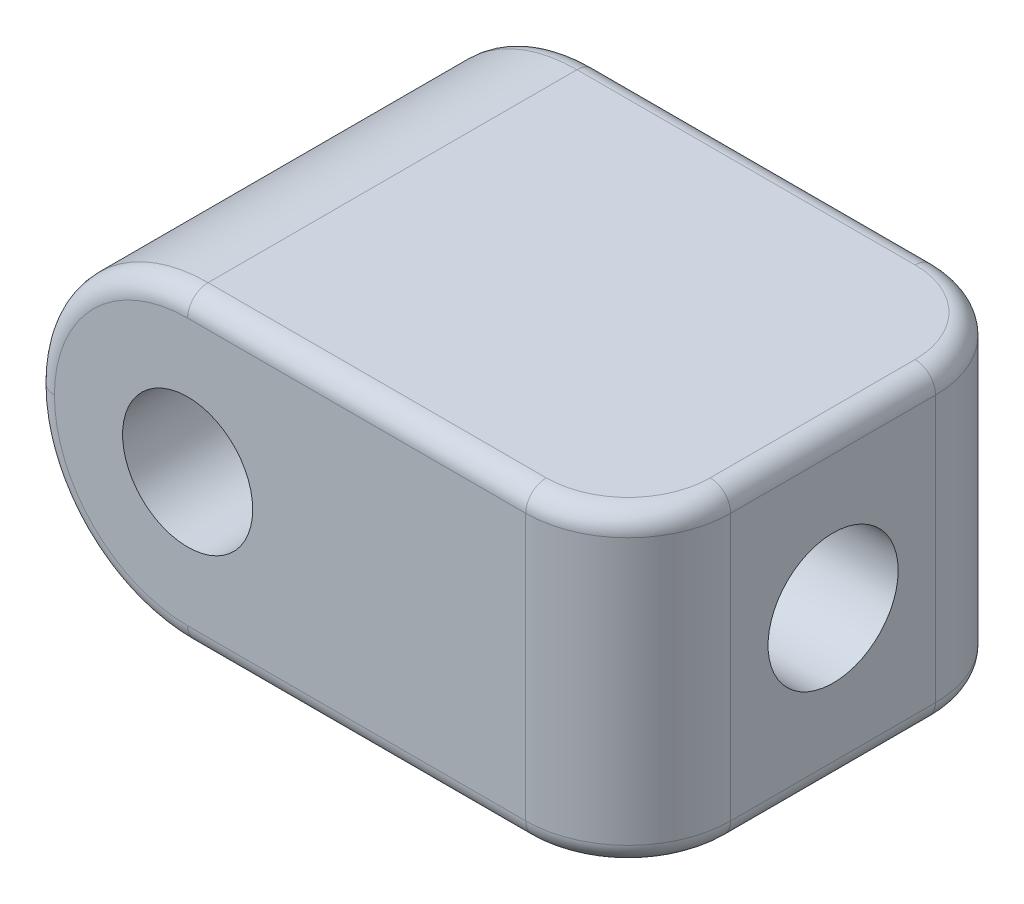
ISO-10303-21;
HEADER;
FILE_DESCRIPTION(('STEP AP214'),'2;1');
FILE_NAME('part.step','',(''),(''),'','','');
FILE_SCHEMA(('AUTOMOTIVE_DESIGN { 1 0 10303 214 1 1 1 1 }'));
ENDSEC;
DATA;
#1=APPLICATION_CONTEXT('core data for automotive mechanical design processes');
#2=APPLICATION_PROTOCOL_DEFINITION('international standard','automotive_design',2000,#1);
#3=PRODUCT_CONTEXT('',#1,'mechanical');
#4=PRODUCT('Part','Part','',(#3));
#5=PRODUCT_RELATED_PRODUCT_CATEGORY('part','',(#4));
#6=PRODUCT_DEFINITION_FORMATION('','',#4);
#7=PRODUCT_DEFINITION_CONTEXT('part definition',#1,'design');
#8=PRODUCT_DEFINITION('design','',#6,#7);
#9=PRODUCT_DEFINITION_SHAPE('','',#8);
#10=(LENGTH_UNIT() NAMED_UNIT(*) SI_UNIT(.MILLI.,.METRE.));
#11=(NAMED_UNIT(*) PLANE_ANGLE_UNIT() SI_UNIT($,.RADIAN.));
#12=(NAMED_UNIT(*) SI_UNIT($,.STERADIAN.) SOLID_ANGLE_UNIT());
#13=UNCERTAINTY_MEASURE_WITH_UNIT(LENGTH_MEASURE(1.E-05),#10,'distance_accuracy_value','');
#14=(GEOMETRIC_REPRESENTATION_CONTEXT(3) GLOBAL_UNCERTAINTY_ASSIGNED_CONTEXT((#13)) GLOBAL_UNIT_ASSIGNED_CONTEXT((#10,
#11,#12)) REPRESENTATION_CONTEXT('',''));
#15=CARTESIAN_POINT('',(0.,0.,0.));
#16=DIRECTION('',(0.,0.,1.));
#17=DIRECTION('',(1.,0.,0.));
#18=AXIS2_PLACEMENT_3D('',#15,#16,#17);
#19=CARTESIAN_POINT('',(-14.5,7.5,10.));
#20=DIRECTION('',(0.,0.,-1.));
#21=DIRECTION('',(-1.,0.,0.));
#22=AXIS2_PLACEMENT_3D('',#19,#20,#21);
#23=PLANE('',#22);
#24=CARTESIAN_POINT('',(-7.,0.,10.));
#25=DIRECTION('',(0.,0.,1.));
#26=DIRECTION('',(1.,0.,0.));
#27=AXIS2_PLACEMENT_3D('',#24,#25,#26);
#28=CIRCLE('',#27,3.175);
#29=CARTESIAN_POINT('',(-3.825,0.,10.));
#30=VERTEX_POINT('',#29);
#31=EDGE_CURVE('E147',#30,#30,#28,.T.);
#32=ORIENTED_EDGE('',*,*,#31,.F.);
#33=EDGE_LOOP('',(#32));
#34=FACE_BOUND('',#33,.T.);
#35=CARTESIAN_POINT('',(-7.,0.,10.));
#36=DIRECTION('',(0.,0.,-1.));
#37=DIRECTION('',(-1.,0.,0.));
#38=AXIS2_PLACEMENT_3D('',#35,#36,#37);
#39=CIRCLE('',#38,6.5);
#40=CARTESIAN_POINT('',(-13.5,0.,10.));
#41=VERTEX_POINT('',#40);
#42=CARTESIAN_POINT('',(-7.,-6.5,10.));
#43=VERTEX_POINT('',#42);
#44=EDGE_CURVE('E180',#41,#43,#39,.F.);
#45=ORIENTED_EDGE('',*,*,#44,.T.);
#46=DIRECTION('',(1.,0.,0.));
#47=VECTOR('',#46,1.);
#48=CARTESIAN_POINT('',(-14.5,-6.5,10.));
#49=LINE('',#48,#47);
#50=CARTESIAN_POINT('',(9.5,-6.5,10.));
#51=VERTEX_POINT('',#50);
#52=EDGE_CURVE('E182',#43,#51,#49,.T.);
#53=ORIENTED_EDGE('',*,*,#52,.T.);
#54=DIRECTION('',(0.,-1.,0.));
#55=VECTOR('',#54,1.);
#56=CARTESIAN_POINT('',(9.5,7.5,10.));
#57=LINE('',#56,#55);
#58=CARTESIAN_POINT('',(9.5,6.5,10.));
#59=VERTEX_POINT('',#58);
#60=EDGE_CURVE('E172',#51,#59,#57,.F.);
#61=ORIENTED_EDGE('',*,*,#60,.T.);
#62=DIRECTION('',(1.,0.,0.));
#63=VECTOR('',#62,1.);
#64=CARTESIAN_POINT('',(-7.,6.5,10.));
#65=LINE('',#64,#63);
#66=CARTESIAN_POINT('',(-7.,6.5,10.));
#67=VERTEX_POINT('',#66);
#68=EDGE_CURVE('E175',#59,#67,#65,.F.);
#69=ORIENTED_EDGE('',*,*,#68,.T.);
#70=CARTESIAN_POINT('',(-7.,0.,10.));
#71=DIRECTION('',(0.,0.,-1.));
#72=DIRECTION('',(-1.,0.,0.));
#73=AXIS2_PLACEMENT_3D('',#70,#71,#72);
#74=CIRCLE('',#73,6.5);
#75=EDGE_CURVE('E177',#67,#41,#74,.F.);
#76=ORIENTED_EDGE('',*,*,#75,.T.);
#77=EDGE_LOOP('',(#45,#53,#61,#69,#76));
#78=FACE_BOUND('',#77,.T.);
#79=ADVANCED_FACE('F31',(#34,#78),#23,.F.);
#80=CARTESIAN_POINT('',(14.5,7.5,-10.));
#81=DIRECTION('',(-1.,0.,0.));
#82=DIRECTION('',(0.,0.,1.));
#83=AXIS2_PLACEMENT_3D('',#80,#81,#82);
#84=PLANE('',#83);
#85=CARTESIAN_POINT('',(14.5,0.,0.));
#86=DIRECTION('',(1.,0.,0.));
#87=DIRECTION('',(0.,0.,-1.));
#88=AXIS2_PLACEMENT_3D('',#85,#86,#87);
#89=CIRCLE('',#88,3.175);
#90=CARTESIAN_POINT('',(14.5,0.,-3.175));
#91=VERTEX_POINT('',#90);
#92=EDGE_CURVE('E140',#91,#91,#89,.T.);
#93=ORIENTED_EDGE('',*,*,#92,.F.);
#94=EDGE_LOOP('',(#93));
#95=FACE_BOUND('',#94,.T.);
#96=DIRECTION('',(0.,-1.,0.));
#97=VECTOR('',#96,1.);
#98=CARTESIAN_POINT('',(14.5,7.5,5.));
#99=LINE('',#98,#97);
#100=CARTESIAN_POINT('',(14.5,6.5,5.));
#101=VERTEX_POINT('',#100);
#102=CARTESIAN_POINT('',(14.5,-6.5,5.));
#103=VERTEX_POINT('',#102);
#104=EDGE_CURVE('E166',#101,#103,#99,.T.);
#105=ORIENTED_EDGE('',*,*,#104,.T.);
#106=DIRECTION('',(0.,0.,-1.));
#107=VECTOR('',#106,1.);
#108=CARTESIAN_POINT('',(14.5,-6.5,-10.));
#109=LINE('',#108,#107);
#110=CARTESIAN_POINT('',(14.5,-6.5,-5.));
#111=VERTEX_POINT('',#110);
#112=EDGE_CURVE('E209',#103,#111,#109,.T.);
#113=ORIENTED_EDGE('',*,*,#112,.T.);
#114=DIRECTION('',(0.,-1.,0.));
#115=VECTOR('',#114,1.);
#116=CARTESIAN_POINT('',(14.5,7.5,-5.));
#117=LINE('',#116,#115);
#118=CARTESIAN_POINT('',(14.5,6.5,-5.));
#119=VERTEX_POINT('',#118);
#120=EDGE_CURVE('E169',#111,#119,#117,.F.);
#121=ORIENTED_EDGE('',*,*,#120,.T.);
#122=DIRECTION('',(0.,0.,-1.));
#123=VECTOR('',#122,1.);
#124=CARTESIAN_POINT('',(14.5,6.5,5.));
#125=LINE('',#124,#123);
#126=EDGE_CURVE('E207',#119,#101,#125,.F.);
#127=ORIENTED_EDGE('',*,*,#126,.T.);
#128=EDGE_LOOP('',(#105,#113,#121,#127));
#129=FACE_BOUND('',#128,.T.);
#130=ADVANCED_FACE('F351',(#95,#129),#84,.F.);
#131=CARTESIAN_POINT('',(-14.5,7.5,-10.));
#132=DIRECTION('',(0.,0.,1.));
#133=DIRECTION('',(1.,0.,0.));
#134=AXIS2_PLACEMENT_3D('',#131,#132,#133);
#135=PLANE('',#134);
#136=CARTESIAN_POINT('',(-7.,0.,-10.));
#137=DIRECTION('',(0.,0.,1.));
#138=DIRECTION('',(1.,0.,0.));
#139=AXIS2_PLACEMENT_3D('',#136,#137,#138);
#140=CIRCLE('',#139,3.175);
#141=CARTESIAN_POINT('',(-3.825,0.,-10.));
#142=VERTEX_POINT('',#141);
#143=EDGE_CURVE('E152',#142,#142,#140,.T.);
#144=ORIENTED_EDGE('',*,*,#143,.T.);
#145=EDGE_LOOP('',(#144));
#146=FACE_BOUND('',#145,.T.);
#147=DIRECTION('',(0.,-1.,0.));
#148=VECTOR('',#147,1.);
#149=CARTESIAN_POINT('',(9.5,7.5,-10.));
#150=LINE('',#149,#148);
#151=CARTESIAN_POINT('',(9.5,6.5,-10.));
#152=VERTEX_POINT('',#151);
#153=CARTESIAN_POINT('',(9.5,-6.5,-10.));
#154=VERTEX_POINT('',#153);
#155=EDGE_CURVE('E162',#152,#154,#150,.T.);
#156=ORIENTED_EDGE('',*,*,#155,.T.);
#157=DIRECTION('',(-1.,0.,0.));
#158=VECTOR('',#157,1.);
#159=CARTESIAN_POINT('',(-14.5,-6.5,-10.));
#160=LINE('',#159,#158);
#161=CARTESIAN_POINT('',(-7.,-6.5,-10.));
#162=VERTEX_POINT('',#161);
#163=EDGE_CURVE('E221',#154,#162,#160,.T.);
#164=ORIENTED_EDGE('',*,*,#163,.T.);
#165=CARTESIAN_POINT('',(-7.,0.,-10.));
#166=DIRECTION('',(0.,0.,1.));
#167=DIRECTION('',(1.,0.,0.));
#168=AXIS2_PLACEMENT_3D('',#165,#166,#167);
#169=CIRCLE('',#168,6.5);
#170=CARTESIAN_POINT('',(-13.5,0.,-10.));
#171=VERTEX_POINT('',#170);
#172=EDGE_CURVE('E219',#162,#171,#169,.F.);
#173=ORIENTED_EDGE('',*,*,#172,.T.);
#174=CARTESIAN_POINT('',(-7.,0.,-10.));
#175=DIRECTION('',(0.,0.,1.));
#176=DIRECTION('',(1.,0.,0.));
#177=AXIS2_PLACEMENT_3D('',#174,#175,#176);
#178=CIRCLE('',#177,6.5);
#179=CARTESIAN_POINT('',(-7.,6.5,-10.));
#180=VERTEX_POINT('',#179);
#181=EDGE_CURVE('E217',#171,#180,#178,.F.);
#182=ORIENTED_EDGE('',*,*,#181,.T.);
#183=DIRECTION('',(-1.,0.,0.));
#184=VECTOR('',#183,1.);
#185=CARTESIAN_POINT('',(9.49999999999999,6.5,-10.));
#186=LINE('',#185,#184);
#187=EDGE_CURVE('E215',#180,#152,#186,.F.);
#188=ORIENTED_EDGE('',*,*,#187,.T.);
#189=EDGE_LOOP('',(#156,#164,#173,#182,#188));
#190=FACE_BOUND('',#189,.T.);
#191=ADVANCED_FACE('F329',(#146,#190),#135,.F.);
#192=CARTESIAN_POINT('',(-14.5,7.5,10.));
#193=DIRECTION('',(0.,1.,0.));
#194=DIRECTION('',(0.,0.,1.));
#195=AXIS2_PLACEMENT_3D('',#192,#193,#194);
#196=PLANE('',#195);
#197=CARTESIAN_POINT('',(9.5,7.5,-5.));
#198=DIRECTION('',(0.,1.,0.));
#199=DIRECTION('',(0.,0.,1.));
#200=AXIS2_PLACEMENT_3D('',#197,#198,#199);
#201=CIRCLE('',#200,4.);
#202=CARTESIAN_POINT('',(13.5,7.5,-5.));
#203=VERTEX_POINT('',#202);
#204=CARTESIAN_POINT('',(9.5,7.5,-9.));
#205=VERTEX_POINT('',#204);
#206=EDGE_CURVE('E40',#203,#205,#201,.T.);
#207=ORIENTED_EDGE('',*,*,#206,.T.);
#208=DIRECTION('',(-1.,0.,0.));
#209=VECTOR('',#208,1.);
#210=CARTESIAN_POINT('',(-7.00000000000001,7.5,-9.));
#211=LINE('',#210,#209);
#212=CARTESIAN_POINT('',(-7.,7.5,-9.));
#213=VERTEX_POINT('',#212);
#214=EDGE_CURVE('E11',#205,#213,#211,.T.);
#215=ORIENTED_EDGE('',*,*,#214,.T.);
#216=DIRECTION('',(0.,0.,1.));
#217=VECTOR('',#216,1.);
#218=CARTESIAN_POINT('',(-7.,7.5,10.));
#219=LINE('',#218,#217);
#220=CARTESIAN_POINT('',(-7.,7.5,9.));
#221=VERTEX_POINT('',#220);
#222=EDGE_CURVE('E155',#213,#221,#219,.T.);
#223=ORIENTED_EDGE('',*,*,#222,.T.);
#224=DIRECTION('',(1.,0.,0.));
#225=VECTOR('',#224,1.);
#226=CARTESIAN_POINT('',(9.5,7.5,9.));
#227=LINE('',#226,#225);
#228=CARTESIAN_POINT('',(9.5,7.5,9.));
#229=VERTEX_POINT('',#228);
#230=EDGE_CURVE('E223',#221,#229,#227,.T.);
#231=ORIENTED_EDGE('',*,*,#230,.T.);
#232=CARTESIAN_POINT('',(9.5,7.5,5.));
#233=DIRECTION('',(0.,1.,0.));
#234=DIRECTION('',(0.,0.,1.));
#235=AXIS2_PLACEMENT_3D('',#232,#233,#234);
#236=CIRCLE('',#235,4.);
#237=CARTESIAN_POINT('',(13.5,7.5,5.));
#238=VERTEX_POINT('',#237);
#239=EDGE_CURVE('E225',#229,#238,#236,.T.);
#240=ORIENTED_EDGE('',*,*,#239,.T.);
#241=DIRECTION('',(0.,0.,-1.));
#242=VECTOR('',#241,1.);
#243=CARTESIAN_POINT('',(13.5,7.5,-5.));
#244=LINE('',#243,#242);
#245=EDGE_CURVE('E51',#238,#203,#244,.T.);
#246=ORIENTED_EDGE('',*,*,#245,.T.);
#247=EDGE_LOOP('',(#207,#215,#223,#231,#240,#246));
#248=FACE_BOUND('',#247,.T.);
#249=ADVANCED_FACE('F311',(#248),#196,.T.);
#250=CARTESIAN_POINT('',(-14.5,-7.5,10.));
#251=DIRECTION('',(0.,1.,0.));
#252=DIRECTION('',(0.,0.,1.));
#253=AXIS2_PLACEMENT_3D('',#250,#251,#252);
#254=PLANE('',#253);
#255=CARTESIAN_POINT('',(9.5,-7.5,5.));
#256=DIRECTION('',(0.,1.,0.));
#257=DIRECTION('',(0.,0.,1.));
#258=AXIS2_PLACEMENT_3D('',#255,#256,#257);
#259=CIRCLE('',#258,4.);
#260=CARTESIAN_POINT('',(13.5,-7.5,5.));
#261=VERTEX_POINT('',#260);
#262=CARTESIAN_POINT('',(9.5,-7.5,9.));
#263=VERTEX_POINT('',#262);
#264=EDGE_CURVE('E199',#261,#263,#259,.F.);
#265=ORIENTED_EDGE('',*,*,#264,.T.);
#266=DIRECTION('',(1.,0.,0.));
#267=VECTOR('',#266,1.);
#268=CARTESIAN_POINT('',(-14.5,-7.5,9.));
#269=LINE('',#268,#267);
#270=CARTESIAN_POINT('',(-7.,-7.5,9.));
#271=VERTEX_POINT('',#270);
#272=EDGE_CURVE('E201',#263,#271,#269,.F.);
#273=ORIENTED_EDGE('',*,*,#272,.T.);
#274=DIRECTION('',(0.,0.,1.));
#275=VECTOR('',#274,1.);
#276=CARTESIAN_POINT('',(-7.,-7.5,10.));
#277=LINE('',#276,#275);
#278=CARTESIAN_POINT('',(-7.,-7.5,-9.));
#279=VERTEX_POINT('',#278);
#280=EDGE_CURVE('E160',#271,#279,#277,.F.);
#281=ORIENTED_EDGE('',*,*,#280,.T.);
#282=DIRECTION('',(-1.,0.,0.));
#283=VECTOR('',#282,1.);
#284=CARTESIAN_POINT('',(-14.5,-7.5,-9.));
#285=LINE('',#284,#283);
#286=CARTESIAN_POINT('',(9.5,-7.5,-9.));
#287=VERTEX_POINT('',#286);
#288=EDGE_CURVE('E193',#279,#287,#285,.F.);
#289=ORIENTED_EDGE('',*,*,#288,.T.);
#290=CARTESIAN_POINT('',(9.5,-7.5,-5.));
#291=DIRECTION('',(0.,1.,0.));
#292=DIRECTION('',(0.,0.,1.));
#293=AXIS2_PLACEMENT_3D('',#290,#291,#292);
#294=CIRCLE('',#293,4.);
#295=CARTESIAN_POINT('',(13.5,-7.5,-5.));
#296=VERTEX_POINT('',#295);
#297=EDGE_CURVE('E195',#287,#296,#294,.F.);
#298=ORIENTED_EDGE('',*,*,#297,.T.);
#299=DIRECTION('',(0.,0.,-1.));
#300=VECTOR('',#299,1.);
#301=CARTESIAN_POINT('',(13.5,-7.5,10.));
#302=LINE('',#301,#300);
#303=EDGE_CURVE('E197',#296,#261,#302,.F.);
#304=ORIENTED_EDGE('',*,*,#303,.T.);
#305=EDGE_LOOP('',(#265,#273,#281,#289,#298,#304));
#306=FACE_BOUND('',#305,.T.);
#307=ADVANCED_FACE('F284',(#306),#254,.F.);
#308=CARTESIAN_POINT('',(-7.,0.,-10.));
#309=DIRECTION('',(0.,0.,1.));
#310=DIRECTION('',(1.,0.,0.));
#311=AXIS2_PLACEMENT_3D('',#308,#309,#310);
#312=CYLINDRICAL_SURFACE('',#311,3.175);
#313=CARTESIAN_POINT('',(-7.,0.,0.));
#314=DIRECTION('',(0.707106781186547,0.,-0.707106781186548));
#315=DIRECTION('',(0.707106781186548,0.,0.707106781186547));
#316=AXIS2_PLACEMENT_3D('',#313,#314,#315);
#317=ELLIPSE('',#316,4.49012806053458,3.175);
#318=CARTESIAN_POINT('',(-7.,-3.175,0.));
#319=VERTEX_POINT('',#318);
#320=CARTESIAN_POINT('',(-7.,3.175,0.));
#321=VERTEX_POINT('',#320);
#322=EDGE_CURVE('E135',#319,#321,#317,.F.);
#323=ORIENTED_EDGE('',*,*,#322,.F.);
#324=CARTESIAN_POINT('',(-7.,0.,0.));
#325=DIRECTION('',(0.707106781186548,0.,0.707106781186547));
#326=DIRECTION('',(0.707106781186547,0.,-0.707106781186548));
#327=AXIS2_PLACEMENT_3D('',#324,#325,#326);
#328=ELLIPSE('',#327,4.49012806053458,3.175);
#329=EDGE_CURVE('E138',#321,#319,#328,.F.);
#330=ORIENTED_EDGE('',*,*,#329,.F.);
#331=EDGE_LOOP('',(#323,#330));
#332=FACE_BOUND('',#331,.T.);
#333=ORIENTED_EDGE('',*,*,#143,.F.);
#334=EDGE_LOOP('',(#333));
#335=FACE_BOUND('',#334,.T.);
#336=ORIENTED_EDGE('',*,*,#31,.T.);
#337=EDGE_LOOP('',(#336));
#338=FACE_BOUND('',#337,.T.);
#339=ADVANCED_FACE('F142',(#332,#335,#338),#312,.F.);
#340=CARTESIAN_POINT('',(-7.,0.,-10.));
#341=DIRECTION('',(0.,0.,1.));
#342=DIRECTION('',(1.,0.,0.));
#343=AXIS2_PLACEMENT_3D('',#340,#341,#342);
#344=CYLINDRICAL_SURFACE('',#343,7.5);
#345=ORIENTED_EDGE('',*,*,#280,.F.);
#346=CARTESIAN_POINT('',(-7.,0.,9.));
#347=DIRECTION('',(0.,0.,-1.));
#348=DIRECTION('',(-1.,0.,0.));
#349=AXIS2_PLACEMENT_3D('',#346,#347,#348);
#350=CIRCLE('',#349,7.5);
#351=CARTESIAN_POINT('',(-14.5,0.,9.));
#352=VERTEX_POINT('',#351);
#353=EDGE_CURVE('E191',#271,#352,#350,.T.);
#354=ORIENTED_EDGE('',*,*,#353,.T.);
#355=DIRECTION('',(0.,0.,1.));
#356=VECTOR('',#355,1.);
#357=CARTESIAN_POINT('',(-14.5,0.,-10.));
#358=LINE('',#357,#356);
#359=CARTESIAN_POINT('',(-14.5,0.,-9.));
#360=VERTEX_POINT('',#359);
#361=EDGE_CURVE('E144',#360,#352,#358,.T.);
#362=ORIENTED_EDGE('',*,*,#361,.F.);
#363=CARTESIAN_POINT('',(-7.,0.,-9.));
#364=DIRECTION('',(0.,0.,1.));
#365=DIRECTION('',(1.,0.,0.));
#366=AXIS2_PLACEMENT_3D('',#363,#364,#365);
#367=CIRCLE('',#366,7.5);
#368=EDGE_CURVE('E189',#360,#279,#367,.T.);
#369=ORIENTED_EDGE('',*,*,#368,.T.);
#370=EDGE_LOOP('',(#345,#354,#362,#369));
#371=FACE_BOUND('',#370,.T.);
#372=ADVANCED_FACE('F281',(#371),#344,.T.);
#373=CARTESIAN_POINT('',(-7.,0.,10.));
#374=DIRECTION('',(0.,0.,-1.));
#375=DIRECTION('',(-1.,0.,0.));
#376=AXIS2_PLACEMENT_3D('',#373,#374,#375);
#377=CYLINDRICAL_SURFACE('',#376,7.5);
#378=ORIENTED_EDGE('',*,*,#361,.T.);
#379=CARTESIAN_POINT('',(-7.,0.,9.));
#380=DIRECTION('',(0.,0.,-1.));
#381=DIRECTION('',(-1.,0.,0.));
#382=AXIS2_PLACEMENT_3D('',#379,#380,#381);
#383=CIRCLE('',#382,7.5);
#384=EDGE_CURVE('E186',#352,#221,#383,.T.);
#385=ORIENTED_EDGE('',*,*,#384,.T.);
#386=ORIENTED_EDGE('',*,*,#222,.F.);
#387=CARTESIAN_POINT('',(-7.,0.,-9.));
#388=DIRECTION('',(0.,0.,1.));
#389=DIRECTION('',(1.,0.,0.));
#390=AXIS2_PLACEMENT_3D('',#387,#388,#389);
#391=CIRCLE('',#390,7.5);
#392=EDGE_CURVE('E184',#213,#360,#391,.T.);
#393=ORIENTED_EDGE('',*,*,#392,.T.);
#394=EDGE_LOOP('',(#378,#385,#386,#393));
#395=FACE_BOUND('',#394,.T.);
#396=ADVANCED_FACE('F299',(#395),#377,.T.);
#397=CARTESIAN_POINT('',(-14.501,0.,0.));
#398=DIRECTION('',(1.,0.,0.));
#399=DIRECTION('',(0.,0.,-1.));
#400=AXIS2_PLACEMENT_3D('',#397,#398,#399);
#401=CYLINDRICAL_SURFACE('',#400,3.175);
#402=ORIENTED_EDGE('',*,*,#92,.T.);
#403=EDGE_LOOP('',(#402));
#404=FACE_BOUND('',#403,.T.);
#405=ORIENTED_EDGE('',*,*,#329,.T.);
#406=ORIENTED_EDGE('',*,*,#322,.T.);
#407=EDGE_LOOP('',(#405,#406));
#408=FACE_BOUND('',#407,.T.);
#409=ADVANCED_FACE('F137',(#404,#408),#401,.F.);
#410=CARTESIAN_POINT('',(9.5,7.5,-5.));
#411=DIRECTION('',(0.,-1.,0.));
#412=DIRECTION('',(0.,0.,-1.));
#413=AXIS2_PLACEMENT_3D('',#410,#411,#412);
#414=CYLINDRICAL_SURFACE('',#413,5.);
#415=ORIENTED_EDGE('',*,*,#120,.F.);
#416=CARTESIAN_POINT('',(9.5,-6.5,-5.));
#417=DIRECTION('',(0.,1.,0.));
#418=DIRECTION('',(0.,0.,1.));
#419=AXIS2_PLACEMENT_3D('',#416,#417,#418);
#420=CIRCLE('',#419,5.);
#421=EDGE_CURVE('E213',#111,#154,#420,.T.);
#422=ORIENTED_EDGE('',*,*,#421,.T.);
#423=ORIENTED_EDGE('',*,*,#155,.F.);
#424=CARTESIAN_POINT('',(9.5,6.5,-5.));
#425=DIRECTION('',(0.,1.,0.));
#426=DIRECTION('',(0.,0.,1.));
#427=AXIS2_PLACEMENT_3D('',#424,#425,#426);
#428=CIRCLE('',#427,5.);
#429=EDGE_CURVE('E211',#152,#119,#428,.F.);
#430=ORIENTED_EDGE('',*,*,#429,.T.);
#431=EDGE_LOOP('',(#415,#422,#423,#430));
#432=FACE_BOUND('',#431,.T.);
#433=ADVANCED_FACE('F332',(#432),#414,.T.);
#434=CARTESIAN_POINT('',(9.5,7.5,5.));
#435=DIRECTION('',(0.,-1.,0.));
#436=DIRECTION('',(0.,0.,-1.));
#437=AXIS2_PLACEMENT_3D('',#434,#435,#436);
#438=CYLINDRICAL_SURFACE('',#437,5.);
#439=ORIENTED_EDGE('',*,*,#60,.F.);
#440=CARTESIAN_POINT('',(9.5,-6.5,5.));
#441=DIRECTION('',(0.,1.,0.));
#442=DIRECTION('',(0.,0.,1.));
#443=AXIS2_PLACEMENT_3D('',#440,#441,#442);
#444=CIRCLE('',#443,5.);
#445=EDGE_CURVE('E205',#51,#103,#444,.T.);
#446=ORIENTED_EDGE('',*,*,#445,.T.);
#447=ORIENTED_EDGE('',*,*,#104,.F.);
#448=CARTESIAN_POINT('',(9.5,6.5,5.));
#449=DIRECTION('',(0.,1.,0.));
#450=DIRECTION('',(0.,0.,1.));
#451=AXIS2_PLACEMENT_3D('',#448,#449,#450);
#452=CIRCLE('',#451,5.);
#453=EDGE_CURVE('E203',#101,#59,#452,.F.);
#454=ORIENTED_EDGE('',*,*,#453,.T.);
#455=EDGE_LOOP('',(#439,#446,#447,#454));
#456=FACE_BOUND('',#455,.T.);
#457=ADVANCED_FACE('F349',(#456),#438,.T.);
#458=CARTESIAN_POINT('',(-7.,0.,-9.));
#459=DIRECTION('',(0.,0.,1.));
#460=DIRECTION('',(1.,0.,0.));
#461=AXIS2_PLACEMENT_3D('',#458,#459,#460);
#462=TOROIDAL_SURFACE('',#461,6.5,1.);
#463=CARTESIAN_POINT('',(-7.,-6.5,-9.));
#464=DIRECTION('',(1.,0.,0.));
#465=DIRECTION('',(0.,0.,-1.));
#466=AXIS2_PLACEMENT_3D('',#463,#464,#465);
#467=CIRCLE('',#466,1.);
#468=EDGE_CURVE('E262',#279,#162,#467,.T.);
#469=ORIENTED_EDGE('',*,*,#468,.F.);
#470=ORIENTED_EDGE('',*,*,#368,.F.);
#471=CARTESIAN_POINT('',(-13.5,0.,-9.));
#472=DIRECTION('',(0.,1.,0.));
#473=DIRECTION('',(0.,0.,1.));
#474=AXIS2_PLACEMENT_3D('',#471,#472,#473);
#475=CIRCLE('',#474,1.);
#476=EDGE_CURVE('E35',#171,#360,#475,.T.);
#477=ORIENTED_EDGE('',*,*,#476,.F.);
#478=ORIENTED_EDGE('',*,*,#172,.F.);
#479=EDGE_LOOP('',(#469,#470,#477,#478));
#480=FACE_BOUND('',#479,.T.);
#481=ADVANCED_FACE('F33',(#480),#462,.T.);
#482=CARTESIAN_POINT('',(-7.,0.,-9.));
#483=DIRECTION('',(0.,0.,1.));
#484=DIRECTION('',(1.,0.,0.));
#485=AXIS2_PLACEMENT_3D('',#482,#483,#484);
#486=TOROIDAL_SURFACE('',#485,6.5,1.);
#487=ORIENTED_EDGE('',*,*,#476,.T.);
#488=ORIENTED_EDGE('',*,*,#392,.F.);
#489=CARTESIAN_POINT('',(-7.,6.5,-9.));
#490=DIRECTION('',(1.,0.,0.));
#491=DIRECTION('',(0.,0.,-1.));
#492=AXIS2_PLACEMENT_3D('',#489,#490,#491);
#493=CIRCLE('',#492,1.);
#494=EDGE_CURVE('E260',#180,#213,#493,.T.);
#495=ORIENTED_EDGE('',*,*,#494,.F.);
#496=ORIENTED_EDGE('',*,*,#181,.F.);
#497=EDGE_LOOP('',(#487,#488,#495,#496));
#498=FACE_BOUND('',#497,.T.);
#499=ADVANCED_FACE('F273',(#498),#486,.T.);
#500=CARTESIAN_POINT('',(-14.5,-6.5,-9.));
#501=DIRECTION('',(-1.,0.,0.));
#502=DIRECTION('',(0.,0.,1.));
#503=AXIS2_PLACEMENT_3D('',#500,#501,#502);
#504=CYLINDRICAL_SURFACE('',#503,1.);
#505=ORIENTED_EDGE('',*,*,#468,.T.);
#506=ORIENTED_EDGE('',*,*,#163,.F.);
#507=CARTESIAN_POINT('',(9.5,-6.5,-9.));
#508=DIRECTION('',(1.,0.,0.));
#509=DIRECTION('',(0.,0.,-1.));
#510=AXIS2_PLACEMENT_3D('',#507,#508,#509);
#511=CIRCLE('',#510,1.);
#512=EDGE_CURVE('E257',#287,#154,#511,.T.);
#513=ORIENTED_EDGE('',*,*,#512,.F.);
#514=ORIENTED_EDGE('',*,*,#288,.F.);
#515=EDGE_LOOP('',(#505,#506,#513,#514));
#516=FACE_BOUND('',#515,.T.);
#517=ADVANCED_FACE('F396',(#516),#504,.T.);
#518=CARTESIAN_POINT('',(-14.5,6.5,-9.));
#519=DIRECTION('',(1.,0.,0.));
#520=DIRECTION('',(0.,0.,-1.));
#521=AXIS2_PLACEMENT_3D('',#518,#519,#520);
#522=CYLINDRICAL_SURFACE('',#521,1.);
#523=ORIENTED_EDGE('',*,*,#494,.T.);
#524=ORIENTED_EDGE('',*,*,#214,.F.);
#525=CARTESIAN_POINT('',(9.5,6.5,-9.));
#526=DIRECTION('',(1.,0.,0.));
#527=DIRECTION('',(0.,0.,-1.));
#528=AXIS2_PLACEMENT_3D('',#525,#526,#527);
#529=CIRCLE('',#528,1.);
#530=EDGE_CURVE('E254',#152,#205,#529,.T.);
#531=ORIENTED_EDGE('',*,*,#530,.F.);
#532=ORIENTED_EDGE('',*,*,#187,.F.);
#533=EDGE_LOOP('',(#523,#524,#531,#532));
#534=FACE_BOUND('',#533,.T.);
#535=ADVANCED_FACE('F326',(#534),#522,.T.);
#536=CARTESIAN_POINT('',(9.5,-6.5,-5.));
#537=DIRECTION('',(0.,1.,0.));
#538=DIRECTION('',(0.,0.,1.));
#539=AXIS2_PLACEMENT_3D('',#536,#537,#538);
#540=TOROIDAL_SURFACE('',#539,4.,1.);
#541=ORIENTED_EDGE('',*,*,#512,.T.);
#542=ORIENTED_EDGE('',*,*,#421,.F.);
#543=CARTESIAN_POINT('',(13.5,-6.5,-5.));
#544=DIRECTION('',(0.,0.,1.));
#545=DIRECTION('',(1.,0.,0.));
#546=AXIS2_PLACEMENT_3D('',#543,#544,#545);
#547=CIRCLE('',#546,1.);
#548=EDGE_CURVE('E251',#296,#111,#547,.T.);
#549=ORIENTED_EDGE('',*,*,#548,.F.);
#550=ORIENTED_EDGE('',*,*,#297,.F.);
#551=EDGE_LOOP('',(#541,#542,#549,#550));
#552=FACE_BOUND('',#551,.T.);
#553=ADVANCED_FACE('F336',(#552),#540,.T.);
#554=CARTESIAN_POINT('',(9.5,6.5,-5.));
#555=DIRECTION('',(0.,1.,0.));
#556=DIRECTION('',(0.,0.,1.));
#557=AXIS2_PLACEMENT_3D('',#554,#555,#556);
#558=TOROIDAL_SURFACE('',#557,4.,1.);
#559=ORIENTED_EDGE('',*,*,#530,.T.);
#560=ORIENTED_EDGE('',*,*,#206,.F.);
#561=CARTESIAN_POINT('',(13.5,6.5,-5.));
#562=DIRECTION('',(0.,0.,1.));
#563=DIRECTION('',(1.,0.,0.));
#564=AXIS2_PLACEMENT_3D('',#561,#562,#563);
#565=CIRCLE('',#564,1.);
#566=EDGE_CURVE('E248',#119,#203,#565,.T.);
#567=ORIENTED_EDGE('',*,*,#566,.F.);
#568=ORIENTED_EDGE('',*,*,#429,.F.);
#569=EDGE_LOOP('',(#559,#560,#567,#568));
#570=FACE_BOUND('',#569,.T.);
#571=ADVANCED_FACE('F322',(#570),#558,.T.);
#572=CARTESIAN_POINT('',(13.5,-6.5,-10.));
#573=DIRECTION('',(0.,0.,-1.));
#574=DIRECTION('',(-1.,0.,0.));
#575=AXIS2_PLACEMENT_3D('',#572,#573,#574);
#576=CYLINDRICAL_SURFACE('',#575,1.);
#577=ORIENTED_EDGE('',*,*,#548,.T.);
#578=ORIENTED_EDGE('',*,*,#112,.F.);
#579=CARTESIAN_POINT('',(13.5,-6.5,5.));
#580=DIRECTION('',(0.,0.,1.));
#581=DIRECTION('',(1.,0.,0.));
#582=AXIS2_PLACEMENT_3D('',#579,#580,#581);
#583=CIRCLE('',#582,1.);
#584=EDGE_CURVE('E245',#261,#103,#583,.T.);
#585=ORIENTED_EDGE('',*,*,#584,.F.);
#586=ORIENTED_EDGE('',*,*,#303,.F.);
#587=EDGE_LOOP('',(#577,#578,#585,#586));
#588=FACE_BOUND('',#587,.T.);
#589=ADVANCED_FACE('F341',(#588),#576,.T.);
#590=CARTESIAN_POINT('',(13.5,6.5,10.));
#591=DIRECTION('',(0.,0.,1.));
#592=DIRECTION('',(1.,0.,0.));
#593=AXIS2_PLACEMENT_3D('',#590,#591,#592);
#594=CYLINDRICAL_SURFACE('',#593,1.);
#595=ORIENTED_EDGE('',*,*,#566,.T.);
#596=ORIENTED_EDGE('',*,*,#245,.F.);
#597=CARTESIAN_POINT('',(13.5,6.5,5.));
#598=DIRECTION('',(0.,0.,1.));
#599=DIRECTION('',(1.,0.,0.));
#600=AXIS2_PLACEMENT_3D('',#597,#598,#599);
#601=CIRCLE('',#600,1.);
#602=EDGE_CURVE('E242',#101,#238,#601,.T.);
#603=ORIENTED_EDGE('',*,*,#602,.F.);
#604=ORIENTED_EDGE('',*,*,#126,.F.);
#605=EDGE_LOOP('',(#595,#596,#603,#604));
#606=FACE_BOUND('',#605,.T.);
#607=ADVANCED_FACE('F318',(#606),#594,.T.);
#608=CARTESIAN_POINT('',(9.5,-6.5,5.));
#609=DIRECTION('',(0.,1.,0.));
#610=DIRECTION('',(0.,0.,1.));
#611=AXIS2_PLACEMENT_3D('',#608,#609,#610);
#612=TOROIDAL_SURFACE('',#611,4.,1.);
#613=ORIENTED_EDGE('',*,*,#584,.T.);
#614=ORIENTED_EDGE('',*,*,#445,.F.);
#615=CARTESIAN_POINT('',(9.5,-6.5,9.));
#616=DIRECTION('',(-1.,0.,0.));
#617=DIRECTION('',(0.,0.,1.));
#618=AXIS2_PLACEMENT_3D('',#615,#616,#617);
#619=CIRCLE('',#618,1.);
#620=EDGE_CURVE('E239',#263,#51,#619,.T.);
#621=ORIENTED_EDGE('',*,*,#620,.F.);
#622=ORIENTED_EDGE('',*,*,#264,.F.);
#623=EDGE_LOOP('',(#613,#614,#621,#622));
#624=FACE_BOUND('',#623,.T.);
#625=ADVANCED_FACE('F345',(#624),#612,.T.);
#626=CARTESIAN_POINT('',(9.5,6.5,5.));
#627=DIRECTION('',(0.,1.,0.));
#628=DIRECTION('',(0.,0.,1.));
#629=AXIS2_PLACEMENT_3D('',#626,#627,#628);
#630=TOROIDAL_SURFACE('',#629,4.,1.);
#631=ORIENTED_EDGE('',*,*,#602,.T.);
#632=ORIENTED_EDGE('',*,*,#239,.F.);
#633=CARTESIAN_POINT('',(9.5,6.5,9.));
#634=DIRECTION('',(-1.,0.,0.));
#635=DIRECTION('',(0.,0.,1.));
#636=AXIS2_PLACEMENT_3D('',#633,#634,#635);
#637=CIRCLE('',#636,1.);
#638=EDGE_CURVE('E236',#59,#229,#637,.T.);
#639=ORIENTED_EDGE('',*,*,#638,.F.);
#640=ORIENTED_EDGE('',*,*,#453,.F.);
#641=EDGE_LOOP('',(#631,#632,#639,#640));
#642=FACE_BOUND('',#641,.T.);
#643=ADVANCED_FACE('F313',(#642),#630,.T.);
#644=CARTESIAN_POINT('',(-14.5,-6.5,9.));
#645=DIRECTION('',(1.,0.,0.));
#646=DIRECTION('',(0.,0.,-1.));
#647=AXIS2_PLACEMENT_3D('',#644,#645,#646);
#648=CYLINDRICAL_SURFACE('',#647,1.);
#649=ORIENTED_EDGE('',*,*,#620,.T.);
#650=ORIENTED_EDGE('',*,*,#52,.F.);
#651=CARTESIAN_POINT('',(-7.,-6.5,9.));
#652=DIRECTION('',(-1.,0.,0.));
#653=DIRECTION('',(0.,0.,1.));
#654=AXIS2_PLACEMENT_3D('',#651,#652,#653);
#655=CIRCLE('',#654,1.);
#656=EDGE_CURVE('E233',#271,#43,#655,.T.);
#657=ORIENTED_EDGE('',*,*,#656,.F.);
#658=ORIENTED_EDGE('',*,*,#272,.F.);
#659=EDGE_LOOP('',(#649,#650,#657,#658));
#660=FACE_BOUND('',#659,.T.);
#661=ADVANCED_FACE('F290',(#660),#648,.T.);
#662=CARTESIAN_POINT('',(-14.5,6.5,9.));
#663=DIRECTION('',(-1.,0.,0.));
#664=DIRECTION('',(0.,0.,1.));
#665=AXIS2_PLACEMENT_3D('',#662,#663,#664);
#666=CYLINDRICAL_SURFACE('',#665,1.);
#667=ORIENTED_EDGE('',*,*,#638,.T.);
#668=ORIENTED_EDGE('',*,*,#230,.F.);
#669=CARTESIAN_POINT('',(-7.,6.5,9.));
#670=DIRECTION('',(-1.,0.,0.));
#671=DIRECTION('',(0.,0.,1.));
#672=AXIS2_PLACEMENT_3D('',#669,#670,#671);
#673=CIRCLE('',#672,1.);
#674=EDGE_CURVE('E231',#67,#221,#673,.T.);
#675=ORIENTED_EDGE('',*,*,#674,.F.);
#676=ORIENTED_EDGE('',*,*,#68,.F.);
#677=EDGE_LOOP('',(#667,#668,#675,#676));
#678=FACE_BOUND('',#677,.T.);
#679=ADVANCED_FACE('F308',(#678),#666,.T.);
#680=CARTESIAN_POINT('',(-7.,0.,9.));
#681=DIRECTION('',(0.,0.,-1.));
#682=DIRECTION('',(-1.,0.,0.));
#683=AXIS2_PLACEMENT_3D('',#680,#681,#682);
#684=TOROIDAL_SURFACE('',#683,6.5,1.);
#685=ORIENTED_EDGE('',*,*,#656,.T.);
#686=ORIENTED_EDGE('',*,*,#44,.F.);
#687=CARTESIAN_POINT('',(-13.5,0.,9.));
#688=DIRECTION('',(0.,1.,0.));
#689=DIRECTION('',(0.,0.,1.));
#690=AXIS2_PLACEMENT_3D('',#687,#688,#689);
#691=CIRCLE('',#690,1.);
#692=EDGE_CURVE('E229',#352,#41,#691,.T.);
#693=ORIENTED_EDGE('',*,*,#692,.F.);
#694=ORIENTED_EDGE('',*,*,#353,.F.);
#695=EDGE_LOOP('',(#685,#686,#693,#694));
#696=FACE_BOUND('',#695,.T.);
#697=ADVANCED_FACE('F296',(#696),#684,.T.);
#698=CARTESIAN_POINT('',(-7.,0.,9.));
#699=DIRECTION('',(0.,0.,-1.));
#700=DIRECTION('',(-1.,0.,0.));
#701=AXIS2_PLACEMENT_3D('',#698,#699,#700);
#702=TOROIDAL_SURFACE('',#701,6.5,1.);
#703=ORIENTED_EDGE('',*,*,#674,.T.);
#704=ORIENTED_EDGE('',*,*,#384,.F.);
#705=ORIENTED_EDGE('',*,*,#692,.T.);
#706=ORIENTED_EDGE('',*,*,#75,.F.);
#707=EDGE_LOOP('',(#703,#704,#705,#706));
#708=FACE_BOUND('',#707,.T.);
#709=ADVANCED_FACE('F302',(#708),#702,.T.);
#710=CLOSED_SHELL('',(#79,#130,#191,#249,#307,#339,#372,#396,#409,#433,#457,#481,#499,#517,#535,
#553,#571,#589,#607,#625,#643,#661,#679,#697,#709));
#711=MANIFOLD_SOLID_BREP('B2',#710);
#712=ADVANCED_BREP_SHAPE_REPRESENTATION('',(#18,#711),#14);
#713=SHAPE_DEFINITION_REPRESENTATION(#9,#712);
ENDSEC;
END-ISO-10303-21;
